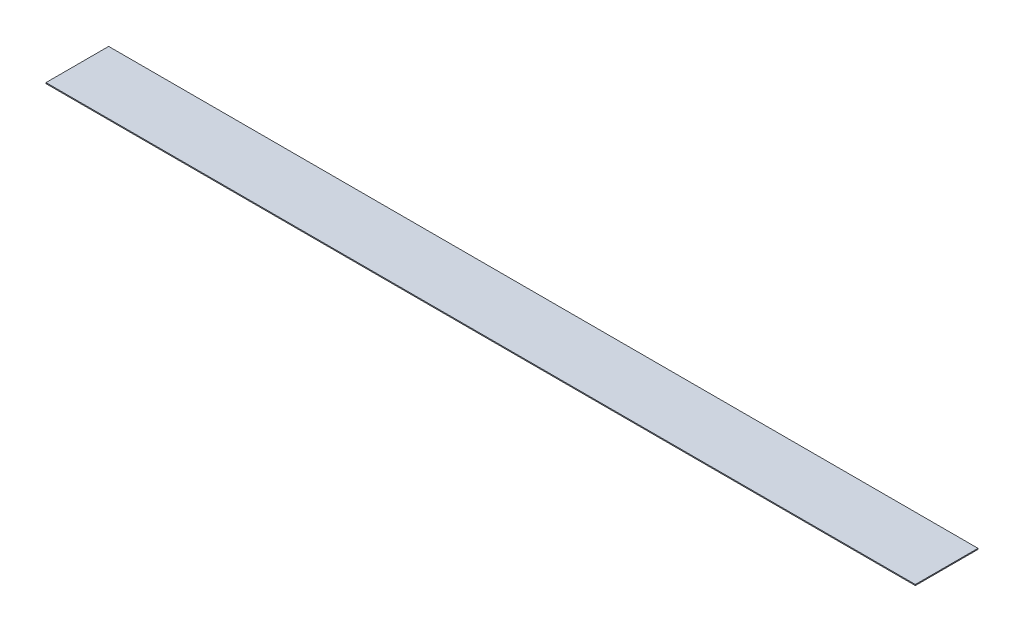
ISO-10303-21;
HEADER;
FILE_DESCRIPTION(('STEP AP214'),'2;1');
FILE_NAME('part.step','',(''),(''),'','','');
FILE_SCHEMA(('AUTOMOTIVE_DESIGN { 1 0 10303 214 1 1 1 1 }'));
ENDSEC;
DATA;
#1=APPLICATION_CONTEXT('core data for automotive mechanical design processes');
#2=APPLICATION_PROTOCOL_DEFINITION('international standard','automotive_design',2000,#1);
#3=PRODUCT_CONTEXT('',#1,'mechanical');
#4=PRODUCT('Part','Part','',(#3));
#5=PRODUCT_RELATED_PRODUCT_CATEGORY('part','',(#4));
#6=PRODUCT_DEFINITION_FORMATION('','',#4);
#7=PRODUCT_DEFINITION_CONTEXT('part definition',#1,'design');
#8=PRODUCT_DEFINITION('design','',#6,#7);
#9=PRODUCT_DEFINITION_SHAPE('','',#8);
#10=(LENGTH_UNIT() NAMED_UNIT(*) SI_UNIT(.MILLI.,.METRE.));
#11=(NAMED_UNIT(*) PLANE_ANGLE_UNIT() SI_UNIT($,.RADIAN.));
#12=(NAMED_UNIT(*) SI_UNIT($,.STERADIAN.) SOLID_ANGLE_UNIT());
#13=UNCERTAINTY_MEASURE_WITH_UNIT(LENGTH_MEASURE(1.E-05),#10,'distance_accuracy_value','');
#14=(GEOMETRIC_REPRESENTATION_CONTEXT(3) GLOBAL_UNCERTAINTY_ASSIGNED_CONTEXT((#13)) GLOBAL_UNIT_ASSIGNED_CONTEXT((#10,
#11,#12)) REPRESENTATION_CONTEXT('',''));
#15=CARTESIAN_POINT('',(0.,0.,0.));
#16=DIRECTION('',(0.,0.,1.));
#17=DIRECTION('',(1.,0.,0.));
#18=AXIS2_PLACEMENT_3D('',#15,#16,#17);
#19=CARTESIAN_POINT('',(0.,1.5875,0.));
#20=DIRECTION('',(1.,0.,0.));
#21=DIRECTION('',(0.,0.,-1.));
#22=AXIS2_PLACEMENT_3D('',#19,#20,#21);
#23=PLANE('',#22);
#24=DIRECTION('',(0.,0.,1.));
#25=VECTOR('',#24,1.);
#26=CARTESIAN_POINT('',(0.,0.,0.));
#27=LINE('',#26,#25);
#28=CARTESIAN_POINT('',(0.,0.,0.));
#29=VERTEX_POINT('',#28);
#30=CARTESIAN_POINT('',(0.,0.,101.6));
#31=VERTEX_POINT('',#30);
#32=EDGE_CURVE('E96',#29,#31,#27,.T.);
#33=ORIENTED_EDGE('',*,*,#32,.T.);
#34=DIRECTION('',(0.,-1.,0.));
#35=VECTOR('',#34,1.);
#36=CARTESIAN_POINT('',(0.,1.5875,101.6));
#37=LINE('',#36,#35);
#38=CARTESIAN_POINT('',(0.,1.5875,101.6));
#39=VERTEX_POINT('',#38);
#40=EDGE_CURVE('E11',#39,#31,#37,.T.);
#41=ORIENTED_EDGE('',*,*,#40,.F.);
#42=DIRECTION('',(0.,0.,1.));
#43=VECTOR('',#42,1.);
#44=CARTESIAN_POINT('',(0.,1.5875,0.));
#45=LINE('',#44,#43);
#46=CARTESIAN_POINT('',(0.,1.5875,0.));
#47=VERTEX_POINT('',#46);
#48=EDGE_CURVE('E84',#47,#39,#45,.T.);
#49=ORIENTED_EDGE('',*,*,#48,.F.);
#50=DIRECTION('',(0.,-1.,0.));
#51=VECTOR('',#50,1.);
#52=CARTESIAN_POINT('',(0.,1.5875,0.));
#53=LINE('',#52,#51);
#54=EDGE_CURVE('E92',#47,#29,#53,.T.);
#55=ORIENTED_EDGE('',*,*,#54,.T.);
#56=EDGE_LOOP('',(#33,#41,#49,#55));
#57=FACE_BOUND('',#56,.T.);
#58=ADVANCED_FACE('F33',(#57),#23,.F.);
#59=CARTESIAN_POINT('',(0.,1.5875,101.6));
#60=DIRECTION('',(0.,0.,-1.));
#61=DIRECTION('',(-1.,0.,0.));
#62=AXIS2_PLACEMENT_3D('',#59,#60,#61);
#63=PLANE('',#62);
#64=DIRECTION('',(1.,0.,0.));
#65=VECTOR('',#64,1.);
#66=CARTESIAN_POINT('',(0.,0.,101.6));
#67=LINE('',#66,#65);
#68=CARTESIAN_POINT('',(1409.7,0.,101.6));
#69=VERTEX_POINT('',#68);
#70=EDGE_CURVE('E88',#31,#69,#67,.T.);
#71=ORIENTED_EDGE('',*,*,#70,.T.);
#72=DIRECTION('',(0.,-1.,0.));
#73=VECTOR('',#72,1.);
#74=CARTESIAN_POINT('',(1409.7,1.5875,101.6));
#75=LINE('',#74,#73);
#76=CARTESIAN_POINT('',(1409.7,1.5875,101.6));
#77=VERTEX_POINT('',#76);
#78=EDGE_CURVE('E41',#77,#69,#75,.T.);
#79=ORIENTED_EDGE('',*,*,#78,.F.);
#80=DIRECTION('',(1.,0.,0.));
#81=VECTOR('',#80,1.);
#82=CARTESIAN_POINT('',(0.,1.5875,101.6));
#83=LINE('',#82,#81);
#84=EDGE_CURVE('E79',#39,#77,#83,.T.);
#85=ORIENTED_EDGE('',*,*,#84,.F.);
#86=ORIENTED_EDGE('',*,*,#40,.T.);
#87=EDGE_LOOP('',(#71,#79,#85,#86));
#88=FACE_BOUND('',#87,.T.);
#89=ADVANCED_FACE('F87',(#88),#63,.F.);
#90=CARTESIAN_POINT('',(1409.7,1.5875,0.));
#91=DIRECTION('',(-1.,0.,0.));
#92=DIRECTION('',(0.,0.,1.));
#93=AXIS2_PLACEMENT_3D('',#90,#91,#92);
#94=PLANE('',#93);
#95=DIRECTION('',(0.,0.,-1.));
#96=VECTOR('',#95,1.);
#97=CARTESIAN_POINT('',(1409.7,0.,0.));
#98=LINE('',#97,#96);
#99=CARTESIAN_POINT('',(1409.7,0.,0.));
#100=VERTEX_POINT('',#99);
#101=EDGE_CURVE('E66',#69,#100,#98,.T.);
#102=ORIENTED_EDGE('',*,*,#101,.T.);
#103=DIRECTION('',(0.,-1.,0.));
#104=VECTOR('',#103,1.);
#105=CARTESIAN_POINT('',(1409.7,1.5875,0.));
#106=LINE('',#105,#104);
#107=CARTESIAN_POINT('',(1409.7,1.5875,0.));
#108=VERTEX_POINT('',#107);
#109=EDGE_CURVE('E89',#108,#100,#106,.T.);
#110=ORIENTED_EDGE('',*,*,#109,.F.);
#111=DIRECTION('',(0.,0.,-1.));
#112=VECTOR('',#111,1.);
#113=CARTESIAN_POINT('',(1409.7,1.5875,0.));
#114=LINE('',#113,#112);
#115=EDGE_CURVE('E82',#77,#108,#114,.T.);
#116=ORIENTED_EDGE('',*,*,#115,.F.);
#117=ORIENTED_EDGE('',*,*,#78,.T.);
#118=EDGE_LOOP('',(#102,#110,#116,#117));
#119=FACE_BOUND('',#118,.T.);
#120=ADVANCED_FACE('F90',(#119),#94,.F.);
#121=CARTESIAN_POINT('',(0.,1.5875,0.));
#122=DIRECTION('',(0.,0.,1.));
#123=DIRECTION('',(1.,0.,0.));
#124=AXIS2_PLACEMENT_3D('',#121,#122,#123);
#125=PLANE('',#124);
#126=DIRECTION('',(-1.,0.,0.));
#127=VECTOR('',#126,1.);
#128=CARTESIAN_POINT('',(0.,0.,0.));
#129=LINE('',#128,#127);
#130=EDGE_CURVE('E72',#100,#29,#129,.T.);
#131=ORIENTED_EDGE('',*,*,#130,.T.);
#132=ORIENTED_EDGE('',*,*,#54,.F.);
#133=DIRECTION('',(-1.,0.,0.));
#134=VECTOR('',#133,1.);
#135=CARTESIAN_POINT('',(0.,1.5875,0.));
#136=LINE('',#135,#134);
#137=EDGE_CURVE('E49',#108,#47,#136,.T.);
#138=ORIENTED_EDGE('',*,*,#137,.F.);
#139=ORIENTED_EDGE('',*,*,#109,.T.);
#140=EDGE_LOOP('',(#131,#132,#138,#139));
#141=FACE_BOUND('',#140,.T.);
#142=ADVANCED_FACE('F103',(#141),#125,.F.);
#143=CARTESIAN_POINT('',(0.,1.5875,0.));
#144=DIRECTION('',(0.,1.,0.));
#145=DIRECTION('',(0.,0.,1.));
#146=AXIS2_PLACEMENT_3D('',#143,#144,#145);
#147=PLANE('',#146);
#148=ORIENTED_EDGE('',*,*,#48,.T.);
#149=ORIENTED_EDGE('',*,*,#84,.T.);
#150=ORIENTED_EDGE('',*,*,#115,.T.);
#151=ORIENTED_EDGE('',*,*,#137,.T.);
#152=EDGE_LOOP('',(#148,#149,#150,#151));
#153=FACE_BOUND('',#152,.T.);
#154=ADVANCED_FACE('F80',(#153),#147,.T.);
#155=CARTESIAN_POINT('',(0.,0.,0.));
#156=DIRECTION('',(0.,1.,0.));
#157=DIRECTION('',(0.,0.,1.));
#158=AXIS2_PLACEMENT_3D('',#155,#156,#157);
#159=PLANE('',#158);
#160=ORIENTED_EDGE('',*,*,#32,.F.);
#161=ORIENTED_EDGE('',*,*,#130,.F.);
#162=ORIENTED_EDGE('',*,*,#101,.F.);
#163=ORIENTED_EDGE('',*,*,#70,.F.);
#164=EDGE_LOOP('',(#160,#161,#162,#163));
#165=FACE_BOUND('',#164,.T.);
#166=ADVANCED_FACE('F106',(#165),#159,.F.);
#167=CLOSED_SHELL('',(#58,#89,#120,#142,#154,#166));
#168=MANIFOLD_SOLID_BREP('B2',#167);
#169=ADVANCED_BREP_SHAPE_REPRESENTATION('',(#18,#168),#14);
#170=SHAPE_DEFINITION_REPRESENTATION(#9,#169);
ENDSEC;
END-ISO-10303-21;
